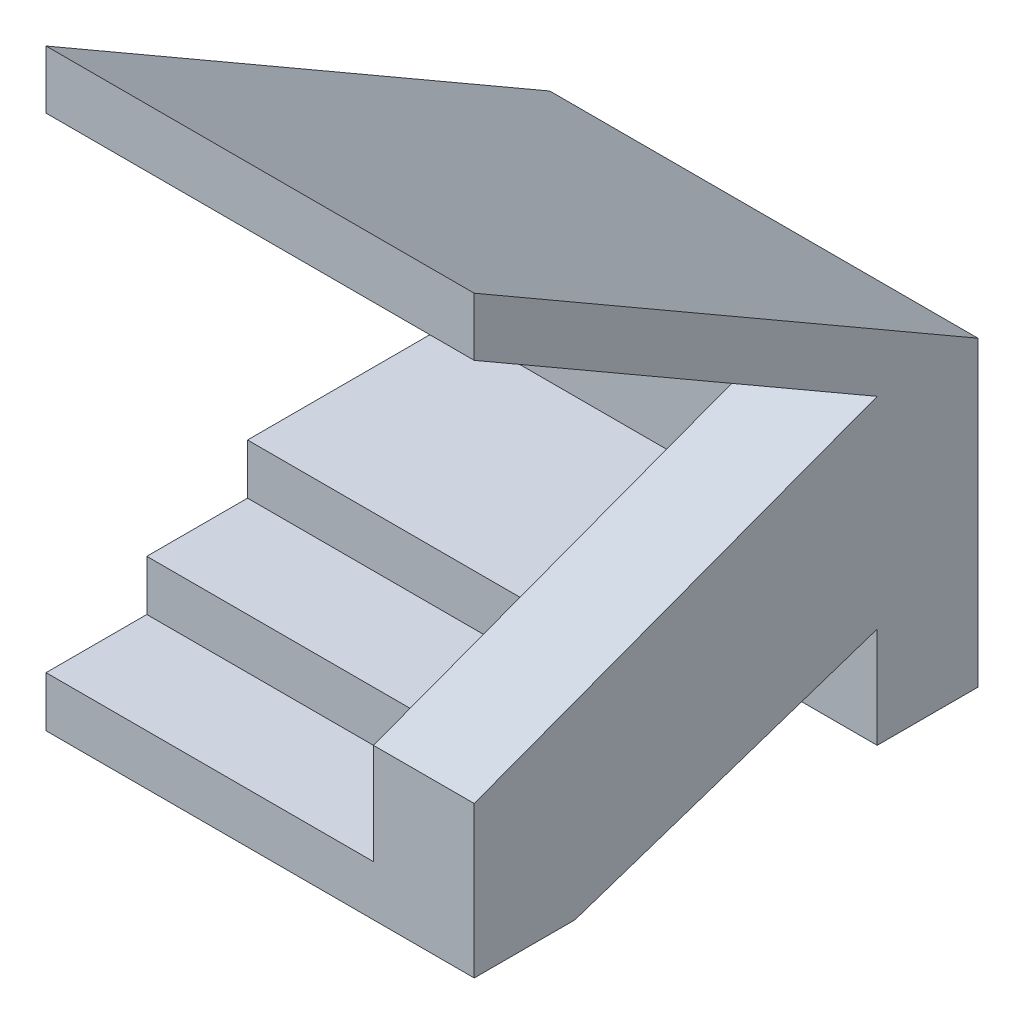
ISO-10303-21;
HEADER;
FILE_DESCRIPTION(('STEP AP214'),'2;1');
FILE_NAME('part.step','',(''),(''),'','','');
FILE_SCHEMA(('AUTOMOTIVE_DESIGN { 1 0 10303 214 1 1 1 1 }'));
ENDSEC;
DATA;
#1=APPLICATION_CONTEXT('core data for automotive mechanical design processes');
#2=APPLICATION_PROTOCOL_DEFINITION('international standard','automotive_design',2000,#1);
#3=PRODUCT_CONTEXT('',#1,'mechanical');
#4=PRODUCT('Part','Part','',(#3));
#5=PRODUCT_RELATED_PRODUCT_CATEGORY('part','',(#4));
#6=PRODUCT_DEFINITION_FORMATION('','',#4);
#7=PRODUCT_DEFINITION_CONTEXT('part definition',#1,'design');
#8=PRODUCT_DEFINITION('design','',#6,#7);
#9=PRODUCT_DEFINITION_SHAPE('','',#8);
#10=(LENGTH_UNIT() NAMED_UNIT(*) SI_UNIT(.MILLI.,.METRE.));
#11=(NAMED_UNIT(*) PLANE_ANGLE_UNIT() SI_UNIT($,.RADIAN.));
#12=(NAMED_UNIT(*) SI_UNIT($,.STERADIAN.) SOLID_ANGLE_UNIT());
#13=UNCERTAINTY_MEASURE_WITH_UNIT(LENGTH_MEASURE(1.E-05),#10,'distance_accuracy_value','');
#14=(GEOMETRIC_REPRESENTATION_CONTEXT(3) GLOBAL_UNCERTAINTY_ASSIGNED_CONTEXT((#13)) GLOBAL_UNIT_ASSIGNED_CONTEXT((#10,
#11,#12)) REPRESENTATION_CONTEXT('',''));
#15=CARTESIAN_POINT('',(0.,0.,0.));
#16=DIRECTION('',(0.,0.,1.));
#17=DIRECTION('',(1.,0.,0.));
#18=AXIS2_PLACEMENT_3D('',#15,#16,#17);
#19=CARTESIAN_POINT('',(85.,0.,0.));
#20=DIRECTION('',(0.,1.,0.));
#21=DIRECTION('',(0.,0.,1.));
#22=AXIS2_PLACEMENT_3D('',#19,#20,#21);
#23=PLANE('',#22);
#24=DIRECTION('',(0.,0.,-1.));
#25=VECTOR('',#24,1.);
#26=CARTESIAN_POINT('',(0.,0.,0.));
#27=LINE('',#26,#25);
#28=CARTESIAN_POINT('',(0.,0.,0.));
#29=VERTEX_POINT('',#28);
#30=CARTESIAN_POINT('',(0.,0.,-20.));
#31=VERTEX_POINT('',#30);
#32=EDGE_CURVE('E160',#29,#31,#27,.T.);
#33=ORIENTED_EDGE('',*,*,#32,.T.);
#34=DIRECTION('',(-1.,0.,0.));
#35=VECTOR('',#34,1.);
#36=CARTESIAN_POINT('',(85.,0.,-20.));
#37=LINE('',#36,#35);
#38=CARTESIAN_POINT('',(85.,0.,-20.));
#39=VERTEX_POINT('',#38);
#40=EDGE_CURVE('E11',#39,#31,#37,.T.);
#41=ORIENTED_EDGE('',*,*,#40,.F.);
#42=DIRECTION('',(0.,0.,-1.));
#43=VECTOR('',#42,1.);
#44=CARTESIAN_POINT('',(85.,0.,0.));
#45=LINE('',#44,#43);
#46=CARTESIAN_POINT('',(85.,0.,0.));
#47=VERTEX_POINT('',#46);
#48=EDGE_CURVE('E200',#47,#39,#45,.T.);
#49=ORIENTED_EDGE('',*,*,#48,.F.);
#50=DIRECTION('',(-1.,0.,0.));
#51=VECTOR('',#50,1.);
#52=CARTESIAN_POINT('',(85.,0.,0.));
#53=LINE('',#52,#51);
#54=EDGE_CURVE('E107',#47,#29,#53,.T.);
#55=ORIENTED_EDGE('',*,*,#54,.T.);
#56=EDGE_LOOP('',(#33,#41,#49,#55));
#57=FACE_BOUND('',#56,.T.);
#58=ADVANCED_FACE('F33',(#57),#23,.F.);
#59=CARTESIAN_POINT('',(85.,0.,-20.));
#60=DIRECTION('',(0.,0.948683298050514,0.316227766016838));
#61=DIRECTION('',(0.,-0.316227766016838,0.948683298050514));
#62=AXIS2_PLACEMENT_3D('',#59,#60,#61);
#63=PLANE('',#62);
#64=DIRECTION('',(0.,0.316227766016838,-0.948683298050514));
#65=VECTOR('',#64,1.);
#66=CARTESIAN_POINT('',(0.,0.,-20.));
#67=LINE('',#66,#65);
#68=CARTESIAN_POINT('',(0.,20.,-80.));
#69=VERTEX_POINT('',#68);
#70=EDGE_CURVE('E162',#31,#69,#67,.T.);
#71=ORIENTED_EDGE('',*,*,#70,.T.);
#72=DIRECTION('',(-1.,0.,0.));
#73=VECTOR('',#72,1.);
#74=CARTESIAN_POINT('',(85.,20.,-80.));
#75=LINE('',#74,#73);
#76=CARTESIAN_POINT('',(85.,20.,-80.));
#77=VERTEX_POINT('',#76);
#78=EDGE_CURVE('E41',#77,#69,#75,.T.);
#79=ORIENTED_EDGE('',*,*,#78,.F.);
#80=DIRECTION('',(0.,0.316227766016838,-0.948683298050514));
#81=VECTOR('',#80,1.);
#82=CARTESIAN_POINT('',(85.,0.,-20.));
#83=LINE('',#82,#81);
#84=EDGE_CURVE('E114',#39,#77,#83,.T.);
#85=ORIENTED_EDGE('',*,*,#84,.F.);
#86=ORIENTED_EDGE('',*,*,#40,.T.);
#87=EDGE_LOOP('',(#71,#79,#85,#86));
#88=FACE_BOUND('',#87,.T.);
#89=ADVANCED_FACE('F230',(#88),#63,.F.);
#90=CARTESIAN_POINT('',(85.,20.,-80.));
#91=DIRECTION('',(0.,0.,-1.));
#92=DIRECTION('',(-1.,0.,0.));
#93=AXIS2_PLACEMENT_3D('',#90,#91,#92);
#94=PLANE('',#93);
#95=DIRECTION('',(0.,-1.,0.));
#96=VECTOR('',#95,1.);
#97=CARTESIAN_POINT('',(0.,20.,-80.));
#98=LINE('',#97,#96);
#99=CARTESIAN_POINT('',(0.,0.,-80.));
#100=VERTEX_POINT('',#99);
#101=EDGE_CURVE('E166',#69,#100,#98,.T.);
#102=ORIENTED_EDGE('',*,*,#101,.T.);
#103=DIRECTION('',(-1.,0.,0.));
#104=VECTOR('',#103,1.);
#105=CARTESIAN_POINT('',(85.,0.,-80.));
#106=LINE('',#105,#104);
#107=CARTESIAN_POINT('',(85.,0.,-80.));
#108=VERTEX_POINT('',#107);
#109=EDGE_CURVE('E221',#108,#100,#106,.T.);
#110=ORIENTED_EDGE('',*,*,#109,.F.);
#111=DIRECTION('',(0.,-1.,0.));
#112=VECTOR('',#111,1.);
#113=CARTESIAN_POINT('',(85.,20.,-80.));
#114=LINE('',#113,#112);
#115=EDGE_CURVE('E228',#77,#108,#114,.T.);
#116=ORIENTED_EDGE('',*,*,#115,.F.);
#117=ORIENTED_EDGE('',*,*,#78,.T.);
#118=EDGE_LOOP('',(#102,#110,#116,#117));
#119=FACE_BOUND('',#118,.T.);
#120=ADVANCED_FACE('F224',(#119),#94,.F.);
#121=CARTESIAN_POINT('',(85.,0.,-80.));
#122=DIRECTION('',(0.,1.,0.));
#123=DIRECTION('',(0.,0.,1.));
#124=AXIS2_PLACEMENT_3D('',#121,#122,#123);
#125=PLANE('',#124);
#126=DIRECTION('',(0.,0.,-1.));
#127=VECTOR('',#126,1.);
#128=CARTESIAN_POINT('',(0.,0.,-80.));
#129=LINE('',#128,#127);
#130=CARTESIAN_POINT('',(0.,2.96637714392034E-13,-100.));
#131=VERTEX_POINT('',#130);
#132=EDGE_CURVE('E169',#100,#131,#129,.T.);
#133=ORIENTED_EDGE('',*,*,#132,.T.);
#134=DIRECTION('',(-1.,0.,0.));
#135=VECTOR('',#134,1.);
#136=CARTESIAN_POINT('',(85.,2.96637714392034E-13,-100.));
#137=LINE('',#136,#135);
#138=CARTESIAN_POINT('',(85.,2.96637714392034E-13,-100.));
#139=VERTEX_POINT('',#138);
#140=EDGE_CURVE('E219',#139,#131,#137,.T.);
#141=ORIENTED_EDGE('',*,*,#140,.F.);
#142=DIRECTION('',(0.,0.,-1.));
#143=VECTOR('',#142,1.);
#144=CARTESIAN_POINT('',(85.,0.,-80.));
#145=LINE('',#144,#143);
#146=EDGE_CURVE('E240',#108,#139,#145,.T.);
#147=ORIENTED_EDGE('',*,*,#146,.F.);
#148=ORIENTED_EDGE('',*,*,#109,.T.);
#149=EDGE_LOOP('',(#133,#141,#147,#148));
#150=FACE_BOUND('',#149,.T.);
#151=ADVANCED_FACE('F238',(#150),#125,.F.);
#152=CARTESIAN_POINT('',(85.,2.96637714392034E-13,-100.));
#153=DIRECTION('',(0.,0.,1.));
#154=DIRECTION('',(1.,0.,0.));
#155=AXIS2_PLACEMENT_3D('',#152,#153,#154);
#156=PLANE('',#155);
#157=DIRECTION('',(0.,1.,0.));
#158=VECTOR('',#157,1.);
#159=CARTESIAN_POINT('',(0.,2.96637714392034E-13,-100.));
#160=LINE('',#159,#158);
#161=CARTESIAN_POINT('',(0.,60.,-100.));
#162=VERTEX_POINT('',#161);
#163=EDGE_CURVE('E172',#131,#162,#160,.T.);
#164=ORIENTED_EDGE('',*,*,#163,.T.);
#165=DIRECTION('',(-1.,0.,0.));
#166=VECTOR('',#165,1.);
#167=CARTESIAN_POINT('',(85.,60.,-100.));
#168=LINE('',#167,#166);
#169=CARTESIAN_POINT('',(85.,60.,-100.));
#170=VERTEX_POINT('',#169);
#171=EDGE_CURVE('E148',#170,#162,#168,.T.);
#172=ORIENTED_EDGE('',*,*,#171,.F.);
#173=DIRECTION('',(0.,1.,0.));
#174=VECTOR('',#173,1.);
#175=CARTESIAN_POINT('',(85.,2.96637714392034E-13,-100.));
#176=LINE('',#175,#174);
#177=EDGE_CURVE('E137',#139,#170,#176,.T.);
#178=ORIENTED_EDGE('',*,*,#177,.F.);
#179=ORIENTED_EDGE('',*,*,#140,.T.);
#180=EDGE_LOOP('',(#164,#172,#178,#179));
#181=FACE_BOUND('',#180,.T.);
#182=ADVANCED_FACE('F309',(#181),#156,.F.);
#183=CARTESIAN_POINT('',(85.,60.,-100.));
#184=DIRECTION('',(0.,-0.86602540378444,0.499999999999998));
#185=DIRECTION('',(0.,-0.499999999999998,-0.86602540378444));
#186=AXIS2_PLACEMENT_3D('',#183,#184,#185);
#187=PLANE('',#186);
#188=DIRECTION('',(0.,0.499999999999998,0.86602540378444));
#189=VECTOR('',#188,1.);
#190=CARTESIAN_POINT('',(0.,60.,-100.));
#191=LINE('',#190,#189);
#192=CARTESIAN_POINT('',(0.,117.735026918962,0.));
#193=VERTEX_POINT('',#192);
#194=EDGE_CURVE('E145',#162,#193,#191,.T.);
#195=ORIENTED_EDGE('',*,*,#194,.T.);
#196=DIRECTION('',(-1.,0.,0.));
#197=VECTOR('',#196,1.);
#198=CARTESIAN_POINT('',(85.,117.735026918962,0.));
#199=LINE('',#198,#197);
#200=CARTESIAN_POINT('',(85.,117.735026918962,0.));
#201=VERTEX_POINT('',#200);
#202=EDGE_CURVE('E142',#201,#193,#199,.T.);
#203=ORIENTED_EDGE('',*,*,#202,.F.);
#204=DIRECTION('',(0.,0.499999999999998,0.86602540378444));
#205=VECTOR('',#204,1.);
#206=CARTESIAN_POINT('',(85.,60.,-100.));
#207=LINE('',#206,#205);
#208=EDGE_CURVE('E129',#170,#201,#207,.T.);
#209=ORIENTED_EDGE('',*,*,#208,.F.);
#210=ORIENTED_EDGE('',*,*,#171,.T.);
#211=EDGE_LOOP('',(#195,#203,#209,#210));
#212=FACE_BOUND('',#211,.T.);
#213=ADVANCED_FACE('F143',(#212),#187,.F.);
#214=CARTESIAN_POINT('',(85.,117.735026918962,0.));
#215=DIRECTION('',(0.,0.,-1.));
#216=DIRECTION('',(0.,1.,0.));
#217=AXIS2_PLACEMENT_3D('',#214,#215,#216);
#218=PLANE('',#217);
#219=DIRECTION('',(0.,-1.,0.));
#220=VECTOR('',#219,1.);
#221=CARTESIAN_POINT('',(0.,117.735026918962,0.));
#222=LINE('',#221,#220);
#223=CARTESIAN_POINT('',(0.,106.18802153517,0.));
#224=VERTEX_POINT('',#223);
#225=EDGE_CURVE('E176',#193,#224,#222,.T.);
#226=ORIENTED_EDGE('',*,*,#225,.T.);
#227=DIRECTION('',(-1.,0.,0.));
#228=VECTOR('',#227,1.);
#229=CARTESIAN_POINT('',(85.,106.18802153517,0.));
#230=LINE('',#229,#228);
#231=CARTESIAN_POINT('',(85.,106.18802153517,0.));
#232=VERTEX_POINT('',#231);
#233=EDGE_CURVE('E149',#232,#224,#230,.T.);
#234=ORIENTED_EDGE('',*,*,#233,.F.);
#235=DIRECTION('',(0.,-1.,0.));
#236=VECTOR('',#235,1.);
#237=CARTESIAN_POINT('',(85.,117.735026918962,0.));
#238=LINE('',#237,#236);
#239=EDGE_CURVE('E134',#201,#232,#238,.T.);
#240=ORIENTED_EDGE('',*,*,#239,.F.);
#241=ORIENTED_EDGE('',*,*,#202,.T.);
#242=EDGE_LOOP('',(#226,#234,#240,#241));
#243=FACE_BOUND('',#242,.T.);
#244=ADVANCED_FACE('F151',(#243),#218,.F.);
#245=CARTESIAN_POINT('',(85.,106.18802153517,0.));
#246=DIRECTION('',(0.,0.86602540378444,-0.499999999999998));
#247=DIRECTION('',(0.,0.499999999999998,0.86602540378444));
#248=AXIS2_PLACEMENT_3D('',#245,#246,#247);
#249=PLANE('',#248);
#250=DIRECTION('',(0.,-0.499999999999998,-0.86602540378444));
#251=VECTOR('',#250,1.);
#252=CARTESIAN_POINT('',(0.,106.18802153517,0.));
#253=LINE('',#252,#251);
#254=CARTESIAN_POINT('',(0.,60.,-80.));
#255=VERTEX_POINT('',#254);
#256=EDGE_CURVE('E178',#224,#255,#253,.T.);
#257=ORIENTED_EDGE('',*,*,#256,.T.);
#258=DIRECTION('',(-1.,0.,0.));
#259=VECTOR('',#258,1.);
#260=CARTESIAN_POINT('',(85.,60.,-80.));
#261=LINE('',#260,#259);
#262=CARTESIAN_POINT('',(65.,60.,-80.));
#263=VERTEX_POINT('',#262);
#264=EDGE_CURVE('E213',#263,#255,#261,.T.);
#265=ORIENTED_EDGE('',*,*,#264,.F.);
#266=CARTESIAN_POINT('',(85.,60.,-80.));
#267=VERTEX_POINT('',#266);
#268=EDGE_CURVE('E214',#267,#263,#261,.T.);
#269=ORIENTED_EDGE('',*,*,#268,.F.);
#270=DIRECTION('',(0.,-0.499999999999998,-0.86602540378444));
#271=VECTOR('',#270,1.);
#272=CARTESIAN_POINT('',(85.,106.18802153517,0.));
#273=LINE('',#272,#271);
#274=EDGE_CURVE('E154',#232,#267,#273,.T.);
#275=ORIENTED_EDGE('',*,*,#274,.F.);
#276=ORIENTED_EDGE('',*,*,#233,.T.);
#277=EDGE_LOOP('',(#257,#265,#269,#275,#276));
#278=FACE_BOUND('',#277,.T.);
#279=ADVANCED_FACE('F317',(#278),#249,.F.);
#280=CARTESIAN_POINT('',(85.,60.,-80.));
#281=DIRECTION('',(0.,0.,-1.));
#282=DIRECTION('',(-1.,0.,0.));
#283=AXIS2_PLACEMENT_3D('',#280,#281,#282);
#284=PLANE('',#283);
#285=DIRECTION('',(-1.,0.,0.));
#286=VECTOR('',#285,1.);
#287=CARTESIAN_POINT('',(85.,30.,-80.));
#288=LINE('',#287,#286);
#289=CARTESIAN_POINT('',(65.,30.,-80.));
#290=VERTEX_POINT('',#289);
#291=CARTESIAN_POINT('',(0.,30.,-80.));
#292=VERTEX_POINT('',#291);
#293=EDGE_CURVE('E211',#290,#292,#288,.T.);
#294=ORIENTED_EDGE('',*,*,#293,.F.);
#295=DIRECTION('',(0.,1.,0.));
#296=VECTOR('',#295,1.);
#297=CARTESIAN_POINT('',(65.,60.,-80.));
#298=LINE('',#297,#296);
#299=EDGE_CURVE('E163',#290,#263,#298,.T.);
#300=ORIENTED_EDGE('',*,*,#299,.T.);
#301=ORIENTED_EDGE('',*,*,#264,.T.);
#302=DIRECTION('',(0.,-1.,0.));
#303=VECTOR('',#302,1.);
#304=CARTESIAN_POINT('',(0.,60.,-80.));
#305=LINE('',#304,#303);
#306=EDGE_CURVE('E181',#255,#292,#305,.T.);
#307=ORIENTED_EDGE('',*,*,#306,.T.);
#308=EDGE_LOOP('',(#294,#300,#301,#307));
#309=FACE_BOUND('',#308,.T.);
#310=ADVANCED_FACE('F320',(#309),#284,.F.);
#311=CARTESIAN_POINT('',(85.,30.,-40.));
#312=DIRECTION('',(0.,-1.,0.));
#313=DIRECTION('',(0.,0.,-1.));
#314=AXIS2_PLACEMENT_3D('',#311,#312,#313);
#315=PLANE('',#314);
#316=DIRECTION('',(-1.,0.,0.));
#317=VECTOR('',#316,1.);
#318=CARTESIAN_POINT('',(85.,30.,-40.));
#319=LINE('',#318,#317);
#320=CARTESIAN_POINT('',(65.,30.,-40.));
#321=VERTEX_POINT('',#320);
#322=CARTESIAN_POINT('',(0.,30.,-40.));
#323=VERTEX_POINT('',#322);
#324=EDGE_CURVE('E209',#321,#323,#319,.T.);
#325=ORIENTED_EDGE('',*,*,#324,.F.);
#326=DIRECTION('',(0.,0.,-1.));
#327=VECTOR('',#326,1.);
#328=CARTESIAN_POINT('',(65.,30.,-40.));
#329=LINE('',#328,#327);
#330=EDGE_CURVE('E248',#321,#290,#329,.T.);
#331=ORIENTED_EDGE('',*,*,#330,.T.);
#332=ORIENTED_EDGE('',*,*,#293,.T.);
#333=DIRECTION('',(0.,0.,1.));
#334=VECTOR('',#333,1.);
#335=CARTESIAN_POINT('',(0.,30.,-40.));
#336=LINE('',#335,#334);
#337=EDGE_CURVE('E184',#292,#323,#336,.T.);
#338=ORIENTED_EDGE('',*,*,#337,.T.);
#339=EDGE_LOOP('',(#325,#331,#332,#338));
#340=FACE_BOUND('',#339,.T.);
#341=ADVANCED_FACE('F324',(#340),#315,.F.);
#342=CARTESIAN_POINT('',(85.,20.,-40.));
#343=DIRECTION('',(0.,0.,-1.));
#344=DIRECTION('',(-1.,0.,0.));
#345=AXIS2_PLACEMENT_3D('',#342,#343,#344);
#346=PLANE('',#345);
#347=DIRECTION('',(-1.,0.,0.));
#348=VECTOR('',#347,1.);
#349=CARTESIAN_POINT('',(85.,20.,-40.));
#350=LINE('',#349,#348);
#351=CARTESIAN_POINT('',(65.,20.,-40.));
#352=VERTEX_POINT('',#351);
#353=CARTESIAN_POINT('',(0.,20.,-40.));
#354=VERTEX_POINT('',#353);
#355=EDGE_CURVE('E207',#352,#354,#350,.T.);
#356=ORIENTED_EDGE('',*,*,#355,.F.);
#357=DIRECTION('',(0.,1.,0.));
#358=VECTOR('',#357,1.);
#359=CARTESIAN_POINT('',(65.,20.,-40.));
#360=LINE('',#359,#358);
#361=EDGE_CURVE('E251',#352,#321,#360,.T.);
#362=ORIENTED_EDGE('',*,*,#361,.T.);
#363=ORIENTED_EDGE('',*,*,#324,.T.);
#364=DIRECTION('',(0.,-1.,0.));
#365=VECTOR('',#364,1.);
#366=CARTESIAN_POINT('',(0.,20.,-40.));
#367=LINE('',#366,#365);
#368=EDGE_CURVE('E187',#323,#354,#367,.T.);
#369=ORIENTED_EDGE('',*,*,#368,.T.);
#370=EDGE_LOOP('',(#356,#362,#363,#369));
#371=FACE_BOUND('',#370,.T.);
#372=ADVANCED_FACE('F328',(#371),#346,.F.);
#373=CARTESIAN_POINT('',(85.,20.,-20.));
#374=DIRECTION('',(0.,-1.,0.));
#375=DIRECTION('',(0.,0.,-1.));
#376=AXIS2_PLACEMENT_3D('',#373,#374,#375);
#377=PLANE('',#376);
#378=DIRECTION('',(-1.,0.,0.));
#379=VECTOR('',#378,1.);
#380=CARTESIAN_POINT('',(85.,20.,-20.));
#381=LINE('',#380,#379);
#382=CARTESIAN_POINT('',(65.,20.,-20.));
#383=VERTEX_POINT('',#382);
#384=CARTESIAN_POINT('',(0.,20.,-20.));
#385=VERTEX_POINT('',#384);
#386=EDGE_CURVE('E205',#383,#385,#381,.T.);
#387=ORIENTED_EDGE('',*,*,#386,.F.);
#388=DIRECTION('',(0.,0.,-1.));
#389=VECTOR('',#388,1.);
#390=CARTESIAN_POINT('',(65.,20.,-20.));
#391=LINE('',#390,#389);
#392=EDGE_CURVE('E254',#383,#352,#391,.T.);
#393=ORIENTED_EDGE('',*,*,#392,.T.);
#394=ORIENTED_EDGE('',*,*,#355,.T.);
#395=DIRECTION('',(0.,0.,1.));
#396=VECTOR('',#395,1.);
#397=CARTESIAN_POINT('',(0.,20.,-20.));
#398=LINE('',#397,#396);
#399=EDGE_CURVE('E190',#354,#385,#398,.T.);
#400=ORIENTED_EDGE('',*,*,#399,.T.);
#401=EDGE_LOOP('',(#387,#393,#394,#400));
#402=FACE_BOUND('',#401,.T.);
#403=ADVANCED_FACE('F332',(#402),#377,.F.);
#404=CARTESIAN_POINT('',(85.,10.,-20.));
#405=DIRECTION('',(0.,0.,-1.));
#406=DIRECTION('',(-1.,0.,0.));
#407=AXIS2_PLACEMENT_3D('',#404,#405,#406);
#408=PLANE('',#407);
#409=DIRECTION('',(-1.,0.,0.));
#410=VECTOR('',#409,1.);
#411=CARTESIAN_POINT('',(85.,10.,-20.));
#412=LINE('',#411,#410);
#413=CARTESIAN_POINT('',(65.,10.,-20.));
#414=VERTEX_POINT('',#413);
#415=CARTESIAN_POINT('',(0.,10.,-20.));
#416=VERTEX_POINT('',#415);
#417=EDGE_CURVE('E203',#414,#416,#412,.T.);
#418=ORIENTED_EDGE('',*,*,#417,.F.);
#419=DIRECTION('',(0.,1.,0.));
#420=VECTOR('',#419,1.);
#421=CARTESIAN_POINT('',(65.,10.,-20.));
#422=LINE('',#421,#420);
#423=EDGE_CURVE('E257',#414,#383,#422,.T.);
#424=ORIENTED_EDGE('',*,*,#423,.T.);
#425=ORIENTED_EDGE('',*,*,#386,.T.);
#426=DIRECTION('',(0.,-1.,0.));
#427=VECTOR('',#426,1.);
#428=CARTESIAN_POINT('',(0.,10.,-20.));
#429=LINE('',#428,#427);
#430=EDGE_CURVE('E193',#385,#416,#429,.T.);
#431=ORIENTED_EDGE('',*,*,#430,.T.);
#432=EDGE_LOOP('',(#418,#424,#425,#431));
#433=FACE_BOUND('',#432,.T.);
#434=ADVANCED_FACE('F336',(#433),#408,.F.);
#435=CARTESIAN_POINT('',(85.,10.,0.));
#436=DIRECTION('',(0.,-1.,0.));
#437=DIRECTION('',(0.,0.,-1.));
#438=AXIS2_PLACEMENT_3D('',#435,#436,#437);
#439=PLANE('',#438);
#440=DIRECTION('',(-1.,0.,0.));
#441=VECTOR('',#440,1.);
#442=CARTESIAN_POINT('',(85.,10.,0.));
#443=LINE('',#442,#441);
#444=CARTESIAN_POINT('',(65.,10.,0.));
#445=VERTEX_POINT('',#444);
#446=CARTESIAN_POINT('',(0.,10.,0.));
#447=VERTEX_POINT('',#446);
#448=EDGE_CURVE('E100',#445,#447,#443,.T.);
#449=ORIENTED_EDGE('',*,*,#448,.F.);
#450=DIRECTION('',(0.,0.,-1.));
#451=VECTOR('',#450,1.);
#452=CARTESIAN_POINT('',(65.,10.,0.));
#453=LINE('',#452,#451);
#454=EDGE_CURVE('E260',#445,#414,#453,.T.);
#455=ORIENTED_EDGE('',*,*,#454,.T.);
#456=ORIENTED_EDGE('',*,*,#417,.T.);
#457=DIRECTION('',(0.,0.,1.));
#458=VECTOR('',#457,1.);
#459=CARTESIAN_POINT('',(0.,10.,0.));
#460=LINE('',#459,#458);
#461=EDGE_CURVE('E196',#416,#447,#460,.T.);
#462=ORIENTED_EDGE('',*,*,#461,.T.);
#463=EDGE_LOOP('',(#449,#455,#456,#462));
#464=FACE_BOUND('',#463,.T.);
#465=ADVANCED_FACE('F293',(#464),#439,.F.);
#466=CARTESIAN_POINT('',(85.,0.,0.));
#467=DIRECTION('',(0.,0.,-1.));
#468=DIRECTION('',(-1.,0.,0.));
#469=AXIS2_PLACEMENT_3D('',#466,#467,#468);
#470=PLANE('',#469);
#471=DIRECTION('',(0.,-1.,0.));
#472=VECTOR('',#471,1.);
#473=CARTESIAN_POINT('',(0.,0.,0.));
#474=LINE('',#473,#472);
#475=EDGE_CURVE('E198',#447,#29,#474,.T.);
#476=ORIENTED_EDGE('',*,*,#475,.T.);
#477=ORIENTED_EDGE('',*,*,#54,.F.);
#478=DIRECTION('',(0.,-1.,0.));
#479=VECTOR('',#478,1.);
#480=CARTESIAN_POINT('',(85.,0.,0.));
#481=LINE('',#480,#479);
#482=CARTESIAN_POINT('',(85.,30.,0.));
#483=VERTEX_POINT('',#482);
#484=EDGE_CURVE('E49',#483,#47,#481,.T.);
#485=ORIENTED_EDGE('',*,*,#484,.F.);
#486=DIRECTION('',(1.,0.,0.));
#487=VECTOR('',#486,1.);
#488=CARTESIAN_POINT('',(65.,30.,0.));
#489=LINE('',#488,#487);
#490=CARTESIAN_POINT('',(65.,30.,0.));
#491=VERTEX_POINT('',#490);
#492=EDGE_CURVE('E263',#491,#483,#489,.T.);
#493=ORIENTED_EDGE('',*,*,#492,.F.);
#494=DIRECTION('',(0.,-1.,0.));
#495=VECTOR('',#494,1.);
#496=CARTESIAN_POINT('',(65.,0.,0.));
#497=LINE('',#496,#495);
#498=EDGE_CURVE('E266',#491,#445,#497,.T.);
#499=ORIENTED_EDGE('',*,*,#498,.T.);
#500=ORIENTED_EDGE('',*,*,#448,.T.);
#501=EDGE_LOOP('',(#476,#477,#485,#493,#499,#500));
#502=FACE_BOUND('',#501,.T.);
#503=ADVANCED_FACE('F289',(#502),#470,.F.);
#504=CARTESIAN_POINT('',(85.,0.,0.));
#505=DIRECTION('',(-1.,0.,0.));
#506=DIRECTION('',(0.,0.,1.));
#507=AXIS2_PLACEMENT_3D('',#504,#505,#506);
#508=PLANE('',#507);
#509=ORIENTED_EDGE('',*,*,#274,.T.);
#510=DIRECTION('',(0.,-0.351123441588392,0.936329177569045));
#511=VECTOR('',#510,1.);
#512=CARTESIAN_POINT('',(85.,30.,0.));
#513=LINE('',#512,#511);
#514=EDGE_CURVE('E267',#267,#483,#513,.T.);
#515=ORIENTED_EDGE('',*,*,#514,.T.);
#516=ORIENTED_EDGE('',*,*,#484,.T.);
#517=ORIENTED_EDGE('',*,*,#48,.T.);
#518=ORIENTED_EDGE('',*,*,#84,.T.);
#519=ORIENTED_EDGE('',*,*,#115,.T.);
#520=ORIENTED_EDGE('',*,*,#146,.T.);
#521=ORIENTED_EDGE('',*,*,#177,.T.);
#522=ORIENTED_EDGE('',*,*,#208,.T.);
#523=ORIENTED_EDGE('',*,*,#239,.T.);
#524=EDGE_LOOP('',(#509,#515,#516,#517,#518,#519,#520,#521,#522,#523));
#525=FACE_BOUND('',#524,.T.);
#526=ADVANCED_FACE('F132',(#525),#508,.F.);
#527=CARTESIAN_POINT('',(0.,0.,0.));
#528=DIRECTION('',(-1.,0.,0.));
#529=DIRECTION('',(0.,0.,1.));
#530=AXIS2_PLACEMENT_3D('',#527,#528,#529);
#531=PLANE('',#530);
#532=ORIENTED_EDGE('',*,*,#32,.F.);
#533=ORIENTED_EDGE('',*,*,#475,.F.);
#534=ORIENTED_EDGE('',*,*,#461,.F.);
#535=ORIENTED_EDGE('',*,*,#430,.F.);
#536=ORIENTED_EDGE('',*,*,#399,.F.);
#537=ORIENTED_EDGE('',*,*,#368,.F.);
#538=ORIENTED_EDGE('',*,*,#337,.F.);
#539=ORIENTED_EDGE('',*,*,#306,.F.);
#540=ORIENTED_EDGE('',*,*,#256,.F.);
#541=ORIENTED_EDGE('',*,*,#225,.F.);
#542=ORIENTED_EDGE('',*,*,#194,.F.);
#543=ORIENTED_EDGE('',*,*,#163,.F.);
#544=ORIENTED_EDGE('',*,*,#132,.F.);
#545=ORIENTED_EDGE('',*,*,#101,.F.);
#546=ORIENTED_EDGE('',*,*,#70,.F.);
#547=EDGE_LOOP('',(#532,#533,#534,#535,#536,#537,#538,#539,#540,#541,#542,#543,#544,#545,#546));
#548=FACE_BOUND('',#547,.T.);
#549=ADVANCED_FACE('F234',(#548),#531,.T.);
#550=CARTESIAN_POINT('',(65.,0.,0.));
#551=DIRECTION('',(-1.,0.,0.));
#552=DIRECTION('',(0.,0.,1.));
#553=AXIS2_PLACEMENT_3D('',#550,#551,#552);
#554=PLANE('',#553);
#555=ORIENTED_EDGE('',*,*,#299,.F.);
#556=ORIENTED_EDGE('',*,*,#330,.F.);
#557=ORIENTED_EDGE('',*,*,#361,.F.);
#558=ORIENTED_EDGE('',*,*,#392,.F.);
#559=ORIENTED_EDGE('',*,*,#423,.F.);
#560=ORIENTED_EDGE('',*,*,#454,.F.);
#561=ORIENTED_EDGE('',*,*,#498,.F.);
#562=DIRECTION('',(0.,-0.351123441588392,0.936329177569045));
#563=VECTOR('',#562,1.);
#564=CARTESIAN_POINT('',(65.,30.,0.));
#565=LINE('',#564,#563);
#566=EDGE_CURVE('E269',#263,#491,#565,.T.);
#567=ORIENTED_EDGE('',*,*,#566,.F.);
#568=EDGE_LOOP('',(#555,#556,#557,#558,#559,#560,#561,#567));
#569=FACE_BOUND('',#568,.T.);
#570=ADVANCED_FACE('F287',(#569),#554,.T.);
#571=CARTESIAN_POINT('',(65.,30.,0.));
#572=DIRECTION('',(0.,0.936329177569045,0.351123441588392));
#573=DIRECTION('',(0.,-0.351123441588392,0.936329177569045));
#574=AXIS2_PLACEMENT_3D('',#571,#572,#573);
#575=PLANE('',#574);
#576=ORIENTED_EDGE('',*,*,#514,.F.);
#577=ORIENTED_EDGE('',*,*,#268,.T.);
#578=ORIENTED_EDGE('',*,*,#566,.T.);
#579=ORIENTED_EDGE('',*,*,#492,.T.);
#580=EDGE_LOOP('',(#576,#577,#578,#579));
#581=FACE_BOUND('',#580,.T.);
#582=ADVANCED_FACE('F277',(#581),#575,.T.);
#583=CLOSED_SHELL('',(#58,#89,#120,#151,#182,#213,#244,#279,#310,#341,#372,#403,#434,#465,#503,
#526,#549,#570,#582));
#584=MANIFOLD_SOLID_BREP('B2',#583);
#585=ADVANCED_BREP_SHAPE_REPRESENTATION('',(#18,#584),#14);
#586=SHAPE_DEFINITION_REPRESENTATION(#9,#585);
ENDSEC;
END-ISO-10303-21;
